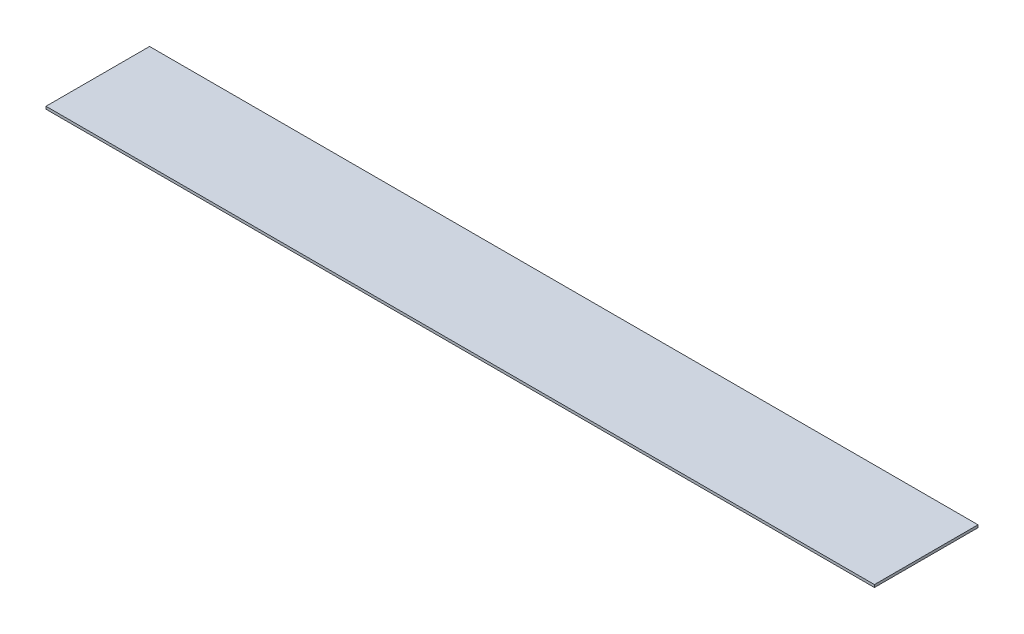
ISO-10303-21;
HEADER;
FILE_DESCRIPTION(('STEP AP214'),'2;1');
FILE_NAME('part.step','',(''),(''),'','','');
FILE_SCHEMA(('AUTOMOTIVE_DESIGN { 1 0 10303 214 1 1 1 1 }'));
ENDSEC;
DATA;
#1=APPLICATION_CONTEXT('core data for automotive mechanical design processes');
#2=APPLICATION_PROTOCOL_DEFINITION('international standard','automotive_design',2000,#1);
#3=PRODUCT_CONTEXT('',#1,'mechanical');
#4=PRODUCT('Part','Part','',(#3));
#5=PRODUCT_RELATED_PRODUCT_CATEGORY('part','',(#4));
#6=PRODUCT_DEFINITION_FORMATION('','',#4);
#7=PRODUCT_DEFINITION_CONTEXT('part definition',#1,'design');
#8=PRODUCT_DEFINITION('design','',#6,#7);
#9=PRODUCT_DEFINITION_SHAPE('','',#8);
#10=(LENGTH_UNIT() NAMED_UNIT(*) SI_UNIT(.MILLI.,.METRE.));
#11=(NAMED_UNIT(*) PLANE_ANGLE_UNIT() SI_UNIT($,.RADIAN.));
#12=(NAMED_UNIT(*) SI_UNIT($,.STERADIAN.) SOLID_ANGLE_UNIT());
#13=UNCERTAINTY_MEASURE_WITH_UNIT(LENGTH_MEASURE(1.E-05),#10,'distance_accuracy_value','');
#14=(GEOMETRIC_REPRESENTATION_CONTEXT(3) GLOBAL_UNCERTAINTY_ASSIGNED_CONTEXT((#13)) GLOBAL_UNIT_ASSIGNED_CONTEXT((#10,
#11,#12)) REPRESENTATION_CONTEXT('',''));
#15=CARTESIAN_POINT('',(0.,0.,0.));
#16=DIRECTION('',(0.,0.,1.));
#17=DIRECTION('',(1.,0.,0.));
#18=AXIS2_PLACEMENT_3D('',#15,#16,#17);
#19=CARTESIAN_POINT('',(0.,1.27,0.));
#20=DIRECTION('',(1.,0.,0.));
#21=DIRECTION('',(0.,0.,-1.));
#22=AXIS2_PLACEMENT_3D('',#19,#20,#21);
#23=PLANE('',#22);
#24=DIRECTION('',(0.,0.,1.));
#25=VECTOR('',#24,1.);
#26=CARTESIAN_POINT('',(0.,0.,0.));
#27=LINE('',#26,#25);
#28=CARTESIAN_POINT('',(0.,0.,-50.8));
#29=VERTEX_POINT('',#28);
#30=CARTESIAN_POINT('',(0.,0.,0.));
#31=VERTEX_POINT('',#30);
#32=EDGE_CURVE('E96',#29,#31,#27,.T.);
#33=ORIENTED_EDGE('',*,*,#32,.T.);
#34=DIRECTION('',(0.,-1.,0.));
#35=VECTOR('',#34,1.);
#36=CARTESIAN_POINT('',(0.,1.27,0.));
#37=LINE('',#36,#35);
#38=CARTESIAN_POINT('',(0.,1.27,0.));
#39=VERTEX_POINT('',#38);
#40=EDGE_CURVE('E11',#39,#31,#37,.T.);
#41=ORIENTED_EDGE('',*,*,#40,.F.);
#42=DIRECTION('',(0.,0.,1.));
#43=VECTOR('',#42,1.);
#44=CARTESIAN_POINT('',(0.,1.27,0.));
#45=LINE('',#44,#43);
#46=CARTESIAN_POINT('',(0.,1.27,-50.8));
#47=VERTEX_POINT('',#46);
#48=EDGE_CURVE('E84',#47,#39,#45,.T.);
#49=ORIENTED_EDGE('',*,*,#48,.F.);
#50=DIRECTION('',(0.,-1.,0.));
#51=VECTOR('',#50,1.);
#52=CARTESIAN_POINT('',(0.,1.27,-50.8));
#53=LINE('',#52,#51);
#54=EDGE_CURVE('E92',#47,#29,#53,.T.);
#55=ORIENTED_EDGE('',*,*,#54,.T.);
#56=EDGE_LOOP('',(#33,#41,#49,#55));
#57=FACE_BOUND('',#56,.T.);
#58=ADVANCED_FACE('F33',(#57),#23,.F.);
#59=CARTESIAN_POINT('',(0.,1.27,0.));
#60=DIRECTION('',(0.,0.,-1.));
#61=DIRECTION('',(-1.,0.,0.));
#62=AXIS2_PLACEMENT_3D('',#59,#60,#61);
#63=PLANE('',#62);
#64=DIRECTION('',(1.,0.,0.));
#65=VECTOR('',#64,1.);
#66=CARTESIAN_POINT('',(0.,0.,0.));
#67=LINE('',#66,#65);
#68=CARTESIAN_POINT('',(406.4,0.,0.));
#69=VERTEX_POINT('',#68);
#70=EDGE_CURVE('E88',#31,#69,#67,.T.);
#71=ORIENTED_EDGE('',*,*,#70,.T.);
#72=DIRECTION('',(0.,-1.,0.));
#73=VECTOR('',#72,1.);
#74=CARTESIAN_POINT('',(406.4,1.27,0.));
#75=LINE('',#74,#73);
#76=CARTESIAN_POINT('',(406.4,1.27,0.));
#77=VERTEX_POINT('',#76);
#78=EDGE_CURVE('E41',#77,#69,#75,.T.);
#79=ORIENTED_EDGE('',*,*,#78,.F.);
#80=DIRECTION('',(1.,0.,0.));
#81=VECTOR('',#80,1.);
#82=CARTESIAN_POINT('',(0.,1.27,0.));
#83=LINE('',#82,#81);
#84=EDGE_CURVE('E79',#39,#77,#83,.T.);
#85=ORIENTED_EDGE('',*,*,#84,.F.);
#86=ORIENTED_EDGE('',*,*,#40,.T.);
#87=EDGE_LOOP('',(#71,#79,#85,#86));
#88=FACE_BOUND('',#87,.T.);
#89=ADVANCED_FACE('F87',(#88),#63,.F.);
#90=CARTESIAN_POINT('',(406.4,1.27,0.));
#91=DIRECTION('',(-1.,0.,0.));
#92=DIRECTION('',(0.,0.,1.));
#93=AXIS2_PLACEMENT_3D('',#90,#91,#92);
#94=PLANE('',#93);
#95=DIRECTION('',(0.,0.,-1.));
#96=VECTOR('',#95,1.);
#97=CARTESIAN_POINT('',(406.4,0.,0.));
#98=LINE('',#97,#96);
#99=CARTESIAN_POINT('',(406.4,0.,-50.8));
#100=VERTEX_POINT('',#99);
#101=EDGE_CURVE('E66',#69,#100,#98,.T.);
#102=ORIENTED_EDGE('',*,*,#101,.T.);
#103=DIRECTION('',(0.,-1.,0.));
#104=VECTOR('',#103,1.);
#105=CARTESIAN_POINT('',(406.4,1.27,-50.8));
#106=LINE('',#105,#104);
#107=CARTESIAN_POINT('',(406.4,1.27,-50.8));
#108=VERTEX_POINT('',#107);
#109=EDGE_CURVE('E89',#108,#100,#106,.T.);
#110=ORIENTED_EDGE('',*,*,#109,.F.);
#111=DIRECTION('',(0.,0.,-1.));
#112=VECTOR('',#111,1.);
#113=CARTESIAN_POINT('',(406.4,1.27,0.));
#114=LINE('',#113,#112);
#115=EDGE_CURVE('E82',#77,#108,#114,.T.);
#116=ORIENTED_EDGE('',*,*,#115,.F.);
#117=ORIENTED_EDGE('',*,*,#78,.T.);
#118=EDGE_LOOP('',(#102,#110,#116,#117));
#119=FACE_BOUND('',#118,.T.);
#120=ADVANCED_FACE('F90',(#119),#94,.F.);
#121=CARTESIAN_POINT('',(0.,1.27,-50.8));
#122=DIRECTION('',(0.,0.,1.));
#123=DIRECTION('',(1.,0.,0.));
#124=AXIS2_PLACEMENT_3D('',#121,#122,#123);
#125=PLANE('',#124);
#126=DIRECTION('',(-1.,0.,0.));
#127=VECTOR('',#126,1.);
#128=CARTESIAN_POINT('',(0.,0.,-50.8));
#129=LINE('',#128,#127);
#130=EDGE_CURVE('E72',#100,#29,#129,.T.);
#131=ORIENTED_EDGE('',*,*,#130,.T.);
#132=ORIENTED_EDGE('',*,*,#54,.F.);
#133=DIRECTION('',(-1.,0.,0.));
#134=VECTOR('',#133,1.);
#135=CARTESIAN_POINT('',(0.,1.27,-50.8));
#136=LINE('',#135,#134);
#137=EDGE_CURVE('E49',#108,#47,#136,.T.);
#138=ORIENTED_EDGE('',*,*,#137,.F.);
#139=ORIENTED_EDGE('',*,*,#109,.T.);
#140=EDGE_LOOP('',(#131,#132,#138,#139));
#141=FACE_BOUND('',#140,.T.);
#142=ADVANCED_FACE('F103',(#141),#125,.F.);
#143=CARTESIAN_POINT('',(0.,1.27,0.));
#144=DIRECTION('',(0.,-1.,0.));
#145=DIRECTION('',(0.,0.,-1.));
#146=AXIS2_PLACEMENT_3D('',#143,#144,#145);
#147=PLANE('',#146);
#148=ORIENTED_EDGE('',*,*,#48,.T.);
#149=ORIENTED_EDGE('',*,*,#84,.T.);
#150=ORIENTED_EDGE('',*,*,#115,.T.);
#151=ORIENTED_EDGE('',*,*,#137,.T.);
#152=EDGE_LOOP('',(#148,#149,#150,#151));
#153=FACE_BOUND('',#152,.T.);
#154=ADVANCED_FACE('F80',(#153),#147,.F.);
#155=CARTESIAN_POINT('',(0.,0.,0.));
#156=DIRECTION('',(0.,-1.,0.));
#157=DIRECTION('',(0.,0.,-1.));
#158=AXIS2_PLACEMENT_3D('',#155,#156,#157);
#159=PLANE('',#158);
#160=ORIENTED_EDGE('',*,*,#32,.F.);
#161=ORIENTED_EDGE('',*,*,#130,.F.);
#162=ORIENTED_EDGE('',*,*,#101,.F.);
#163=ORIENTED_EDGE('',*,*,#70,.F.);
#164=EDGE_LOOP('',(#160,#161,#162,#163));
#165=FACE_BOUND('',#164,.T.);
#166=ADVANCED_FACE('F106',(#165),#159,.T.);
#167=CLOSED_SHELL('',(#58,#89,#120,#142,#154,#166));
#168=MANIFOLD_SOLID_BREP('B2',#167);
#169=ADVANCED_BREP_SHAPE_REPRESENTATION('',(#18,#168),#14);
#170=SHAPE_DEFINITION_REPRESENTATION(#9,#169);
ENDSEC;
END-ISO-10303-21;
